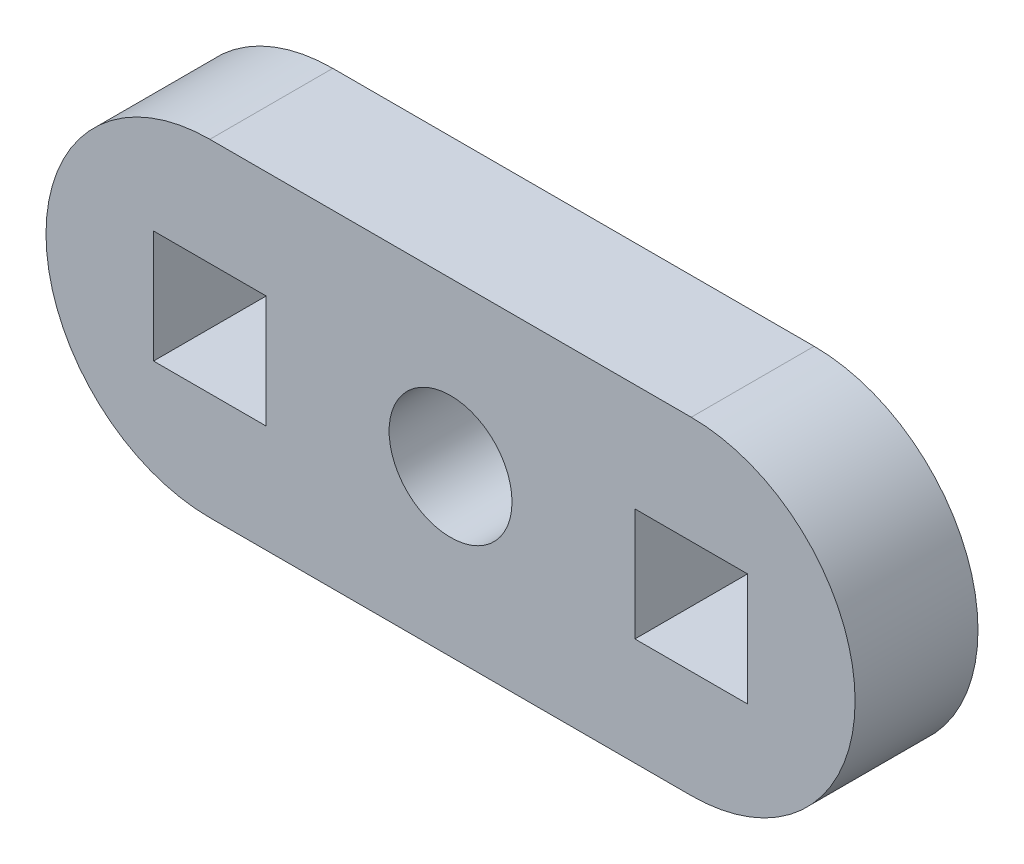
ISO-10303-21;
HEADER;
FILE_DESCRIPTION(('STEP AP214'),'2;1');
FILE_NAME('part.step','',(''),(''),'','','');
FILE_SCHEMA(('AUTOMOTIVE_DESIGN { 1 0 10303 214 1 1 1 1 }'));
ENDSEC;
DATA;
#1=APPLICATION_CONTEXT('core data for automotive mechanical design processes');
#2=APPLICATION_PROTOCOL_DEFINITION('international standard','automotive_design',2000,#1);
#3=PRODUCT_CONTEXT('',#1,'mechanical');
#4=PRODUCT('Part','Part','',(#3));
#5=PRODUCT_RELATED_PRODUCT_CATEGORY('part','',(#4));
#6=PRODUCT_DEFINITION_FORMATION('','',#4);
#7=PRODUCT_DEFINITION_CONTEXT('part definition',#1,'design');
#8=PRODUCT_DEFINITION('design','',#6,#7);
#9=PRODUCT_DEFINITION_SHAPE('','',#8);
#10=(LENGTH_UNIT() NAMED_UNIT(*) SI_UNIT(.MILLI.,.METRE.));
#11=(NAMED_UNIT(*) PLANE_ANGLE_UNIT() SI_UNIT($,.RADIAN.));
#12=(NAMED_UNIT(*) SI_UNIT($,.STERADIAN.) SOLID_ANGLE_UNIT());
#13=UNCERTAINTY_MEASURE_WITH_UNIT(LENGTH_MEASURE(1.E-05),#10,'distance_accuracy_value','');
#14=(GEOMETRIC_REPRESENTATION_CONTEXT(3) GLOBAL_UNCERTAINTY_ASSIGNED_CONTEXT((#13)) GLOBAL_UNIT_ASSIGNED_CONTEXT((#10,
#11,#12)) REPRESENTATION_CONTEXT('',''));
#15=CARTESIAN_POINT('',(0.,0.,0.));
#16=DIRECTION('',(0.,0.,1.));
#17=DIRECTION('',(1.,0.,0.));
#18=AXIS2_PLACEMENT_3D('',#15,#16,#17);
#19=CARTESIAN_POINT('',(48.445015479824,13.9509293096805,6.));
#20=DIRECTION('',(0.,0.,1.));
#21=DIRECTION('',(1.,0.,0.));
#22=AXIS2_PLACEMENT_3D('',#19,#20,#21);
#23=PLANE('',#22);
#24=DIRECTION('',(1.,0.,0.));
#25=VECTOR('',#24,1.);
#26=CARTESIAN_POINT('',(24.945015479824,21.9509293096805,6.));
#27=LINE('',#26,#25);
#28=CARTESIAN_POINT('',(24.945015479824,21.9509293096805,6.));
#29=VERTEX_POINT('',#28);
#30=CARTESIAN_POINT('',(48.445015479824,21.9509293096805,6.));
#31=VERTEX_POINT('',#30);
#32=EDGE_CURVE('E296',#29,#31,#27,.T.);
#33=ORIENTED_EDGE('',*,*,#32,.F.);
#34=CARTESIAN_POINT('',(24.9450154798213,13.9509293096807,6.));
#35=DIRECTION('',(0.,0.,1.));
#36=DIRECTION('',(1.,0.,0.));
#37=AXIS2_PLACEMENT_3D('',#34,#35,#36);
#38=CIRCLE('',#37,7.99999999999977);
#39=CARTESIAN_POINT('',(24.9450154798185,5.95092930968092,6.));
#40=VERTEX_POINT('',#39);
#41=EDGE_CURVE('E307',#29,#40,#38,.T.);
#42=ORIENTED_EDGE('',*,*,#41,.T.);
#43=DIRECTION('',(1.,0.,0.));
#44=VECTOR('',#43,1.);
#45=CARTESIAN_POINT('',(24.9450154798185,5.95092930968092,6.));
#46=LINE('',#45,#44);
#47=CARTESIAN_POINT('',(48.4450154798313,5.95092930968046,6.));
#48=VERTEX_POINT('',#47);
#49=EDGE_CURVE('E304',#40,#48,#46,.T.);
#50=ORIENTED_EDGE('',*,*,#49,.T.);
#51=CARTESIAN_POINT('',(48.445015479824,13.9509293096805,6.));
#52=DIRECTION('',(0.,0.,1.));
#53=DIRECTION('',(1.,0.,0.));
#54=AXIS2_PLACEMENT_3D('',#51,#52,#53);
#55=CIRCLE('',#54,8.);
#56=EDGE_CURVE('E300',#48,#31,#55,.T.);
#57=ORIENTED_EDGE('',*,*,#56,.T.);
#58=EDGE_LOOP('',(#33,#42,#50,#57));
#59=FACE_BOUND('',#58,.T.);
#60=DIRECTION('',(0.,1.,0.));
#61=VECTOR('',#60,1.);
#62=CARTESIAN_POINT('',(45.695015479824,0.,6.));
#63=LINE('',#62,#61);
#64=CARTESIAN_POINT('',(45.695015479824,11.2009293096796,6.));
#65=VERTEX_POINT('',#64);
#66=CARTESIAN_POINT('',(45.695015479824,16.7009293096796,6.));
#67=VERTEX_POINT('',#66);
#68=EDGE_CURVE('E252',#65,#67,#63,.T.);
#69=ORIENTED_EDGE('',*,*,#68,.T.);
#70=DIRECTION('',(1.,0.,0.));
#71=VECTOR('',#70,1.);
#72=CARTESIAN_POINT('',(0.,16.7009293096796,6.));
#73=LINE('',#72,#71);
#74=CARTESIAN_POINT('',(51.195015479824,16.7009293096796,6.));
#75=VERTEX_POINT('',#74);
#76=EDGE_CURVE('E265',#67,#75,#73,.T.);
#77=ORIENTED_EDGE('',*,*,#76,.T.);
#78=DIRECTION('',(0.,-1.,0.));
#79=VECTOR('',#78,1.);
#80=CARTESIAN_POINT('',(51.195015479824,0.,6.));
#81=LINE('',#80,#79);
#82=CARTESIAN_POINT('',(51.195015479824,11.2009293096796,6.));
#83=VERTEX_POINT('',#82);
#84=EDGE_CURVE('E261',#75,#83,#81,.T.);
#85=ORIENTED_EDGE('',*,*,#84,.T.);
#86=DIRECTION('',(-1.,0.,0.));
#87=VECTOR('',#86,1.);
#88=CARTESIAN_POINT('',(0.,11.2009293096796,6.));
#89=LINE('',#88,#87);
#90=EDGE_CURVE('E256',#83,#65,#89,.T.);
#91=ORIENTED_EDGE('',*,*,#90,.T.);
#92=EDGE_LOOP('',(#69,#77,#85,#91));
#93=FACE_BOUND('',#92,.T.);
#94=CARTESIAN_POINT('',(36.695015479824,13.9936662717261,6.));
#95=DIRECTION('',(0.,0.,1.));
#96=DIRECTION('',(1.,0.,0.));
#97=AXIS2_PLACEMENT_3D('',#94,#95,#96);
#98=CIRCLE('',#97,3.);
#99=CARTESIAN_POINT('',(39.695015479824,13.9936662717261,6.));
#100=VERTEX_POINT('',#99);
#101=EDGE_CURVE('E244',#100,#100,#98,.T.);
#102=ORIENTED_EDGE('',*,*,#101,.F.);
#103=EDGE_LOOP('',(#102));
#104=FACE_BOUND('',#103,.T.);
#105=DIRECTION('',(0.,1.,0.));
#106=VECTOR('',#105,1.);
#107=CARTESIAN_POINT('',(27.695015479824,11.2009293096796,6.));
#108=LINE('',#107,#106);
#109=CARTESIAN_POINT('',(27.695015479824,11.2009293096796,6.));
#110=VERTEX_POINT('',#109);
#111=CARTESIAN_POINT('',(27.695015479824,16.7009293096796,6.));
#112=VERTEX_POINT('',#111);
#113=EDGE_CURVE('E205',#110,#112,#108,.T.);
#114=ORIENTED_EDGE('',*,*,#113,.F.);
#115=DIRECTION('',(1.,0.,0.));
#116=VECTOR('',#115,1.);
#117=CARTESIAN_POINT('',(22.195015479824,11.2009293096796,6.));
#118=LINE('',#117,#116);
#119=CARTESIAN_POINT('',(22.195015479824,11.2009293096796,6.));
#120=VERTEX_POINT('',#119);
#121=EDGE_CURVE('E196',#120,#110,#118,.T.);
#122=ORIENTED_EDGE('',*,*,#121,.F.);
#123=DIRECTION('',(0.,-1.,0.));
#124=VECTOR('',#123,1.);
#125=CARTESIAN_POINT('',(22.195015479824,16.7009293096796,6.));
#126=LINE('',#125,#124);
#127=CARTESIAN_POINT('',(22.195015479824,16.7009293096796,6.));
#128=VERTEX_POINT('',#127);
#129=EDGE_CURVE('E222',#128,#120,#126,.T.);
#130=ORIENTED_EDGE('',*,*,#129,.F.);
#131=DIRECTION('',(-1.,0.,0.));
#132=VECTOR('',#131,1.);
#133=CARTESIAN_POINT('',(27.695015479824,16.7009293096796,6.));
#134=LINE('',#133,#132);
#135=EDGE_CURVE('E218',#112,#128,#134,.T.);
#136=ORIENTED_EDGE('',*,*,#135,.F.);
#137=EDGE_LOOP('',(#114,#122,#130,#136));
#138=FACE_BOUND('',#137,.T.);
#139=ADVANCED_FACE('F105',(#59,#93,#104,#138),#23,.T.);
#140=CARTESIAN_POINT('',(48.445015479824,13.9509293096805,0.));
#141=DIRECTION('',(0.,0.,1.));
#142=DIRECTION('',(1.,0.,0.));
#143=AXIS2_PLACEMENT_3D('',#140,#141,#142);
#144=PLANE('',#143);
#145=CARTESIAN_POINT('',(36.695015479824,13.9936662717261,0.));
#146=DIRECTION('',(0.,0.,1.));
#147=DIRECTION('',(1.,0.,0.));
#148=AXIS2_PLACEMENT_3D('',#145,#146,#147);
#149=CIRCLE('',#148,3.);
#150=CARTESIAN_POINT('',(39.695015479824,13.9936662717261,0.));
#151=VERTEX_POINT('',#150);
#152=EDGE_CURVE('E214',#151,#151,#149,.T.);
#153=ORIENTED_EDGE('',*,*,#152,.T.);
#154=EDGE_LOOP('',(#153));
#155=FACE_BOUND('',#154,.T.);
#156=DIRECTION('',(1.,0.,0.));
#157=VECTOR('',#156,1.);
#158=CARTESIAN_POINT('',(24.945015479824,21.9509293096805,0.));
#159=LINE('',#158,#157);
#160=CARTESIAN_POINT('',(24.945015479824,21.9509293096805,0.));
#161=VERTEX_POINT('',#160);
#162=CARTESIAN_POINT('',(48.445015479824,21.9509293096805,0.));
#163=VERTEX_POINT('',#162);
#164=EDGE_CURVE('E295',#161,#163,#159,.T.);
#165=ORIENTED_EDGE('',*,*,#164,.T.);
#166=CARTESIAN_POINT('',(48.445015479824,13.9509293096805,0.));
#167=DIRECTION('',(0.,0.,1.));
#168=DIRECTION('',(1.,0.,0.));
#169=AXIS2_PLACEMENT_3D('',#166,#167,#168);
#170=CIRCLE('',#169,8.);
#171=CARTESIAN_POINT('',(48.4450154798313,5.95092930968046,0.));
#172=VERTEX_POINT('',#171);
#173=EDGE_CURVE('E313',#172,#163,#170,.T.);
#174=ORIENTED_EDGE('',*,*,#173,.F.);
#175=DIRECTION('',(1.,0.,0.));
#176=VECTOR('',#175,1.);
#177=CARTESIAN_POINT('',(24.9450154798185,5.95092930968092,0.));
#178=LINE('',#177,#176);
#179=CARTESIAN_POINT('',(24.9450154798185,5.95092930968092,0.));
#180=VERTEX_POINT('',#179);
#181=EDGE_CURVE('E317',#180,#172,#178,.T.);
#182=ORIENTED_EDGE('',*,*,#181,.F.);
#183=CARTESIAN_POINT('',(24.9450154798213,13.9509293096807,0.));
#184=DIRECTION('',(0.,0.,1.));
#185=DIRECTION('',(1.,0.,0.));
#186=AXIS2_PLACEMENT_3D('',#183,#184,#185);
#187=CIRCLE('',#186,7.99999999999977);
#188=EDGE_CURVE('E301',#161,#180,#187,.T.);
#189=ORIENTED_EDGE('',*,*,#188,.F.);
#190=EDGE_LOOP('',(#165,#174,#182,#189));
#191=FACE_BOUND('',#190,.T.);
#192=DIRECTION('',(1.,0.,0.));
#193=VECTOR('',#192,1.);
#194=CARTESIAN_POINT('',(0.,16.7009293096796,0.));
#195=LINE('',#194,#193);
#196=CARTESIAN_POINT('',(45.695015479824,16.7009293096796,0.));
#197=VERTEX_POINT('',#196);
#198=CARTESIAN_POINT('',(51.195015479824,16.7009293096796,0.));
#199=VERTEX_POINT('',#198);
#200=EDGE_CURVE('E257',#197,#199,#195,.T.);
#201=ORIENTED_EDGE('',*,*,#200,.F.);
#202=DIRECTION('',(0.,1.,0.));
#203=VECTOR('',#202,1.);
#204=CARTESIAN_POINT('',(45.695015479824,0.,0.));
#205=LINE('',#204,#203);
#206=CARTESIAN_POINT('',(45.695015479824,11.2009293096796,0.));
#207=VERTEX_POINT('',#206);
#208=EDGE_CURVE('E248',#207,#197,#205,.T.);
#209=ORIENTED_EDGE('',*,*,#208,.F.);
#210=DIRECTION('',(-1.,0.,0.));
#211=VECTOR('',#210,1.);
#212=CARTESIAN_POINT('',(0.,11.2009293096796,0.));
#213=LINE('',#212,#211);
#214=CARTESIAN_POINT('',(51.195015479824,11.2009293096796,0.));
#215=VERTEX_POINT('',#214);
#216=EDGE_CURVE('E272',#215,#207,#213,.T.);
#217=ORIENTED_EDGE('',*,*,#216,.F.);
#218=DIRECTION('',(0.,-1.,0.));
#219=VECTOR('',#218,1.);
#220=CARTESIAN_POINT('',(51.195015479824,0.,0.));
#221=LINE('',#220,#219);
#222=EDGE_CURVE('E276',#199,#215,#221,.T.);
#223=ORIENTED_EDGE('',*,*,#222,.F.);
#224=EDGE_LOOP('',(#201,#209,#217,#223));
#225=FACE_BOUND('',#224,.T.);
#226=DIRECTION('',(1.,0.,0.));
#227=VECTOR('',#226,1.);
#228=CARTESIAN_POINT('',(22.195015479824,11.2009293096796,0.));
#229=LINE('',#228,#227);
#230=CARTESIAN_POINT('',(22.195015479824,11.2009293096796,0.));
#231=VERTEX_POINT('',#230);
#232=CARTESIAN_POINT('',(27.695015479824,11.2009293096796,0.));
#233=VERTEX_POINT('',#232);
#234=EDGE_CURVE('E131',#231,#233,#229,.T.);
#235=ORIENTED_EDGE('',*,*,#234,.T.);
#236=DIRECTION('',(0.,1.,0.));
#237=VECTOR('',#236,1.);
#238=CARTESIAN_POINT('',(27.695015479824,13.9509293096796,0.));
#239=LINE('',#238,#237);
#240=CARTESIAN_POINT('',(27.695015479824,16.7009293096796,0.));
#241=VERTEX_POINT('',#240);
#242=EDGE_CURVE('E212',#233,#241,#239,.T.);
#243=ORIENTED_EDGE('',*,*,#242,.T.);
#244=DIRECTION('',(-1.,0.,0.));
#245=VECTOR('',#244,1.);
#246=CARTESIAN_POINT('',(27.695015479824,16.7009293096796,0.));
#247=LINE('',#246,#245);
#248=CARTESIAN_POINT('',(22.195015479824,16.7009293096796,0.));
#249=VERTEX_POINT('',#248);
#250=EDGE_CURVE('E231',#241,#249,#247,.T.);
#251=ORIENTED_EDGE('',*,*,#250,.T.);
#252=DIRECTION('',(0.,-1.,0.));
#253=VECTOR('',#252,1.);
#254=CARTESIAN_POINT('',(22.195015479824,16.7009293096796,0.));
#255=LINE('',#254,#253);
#256=EDGE_CURVE('E206',#249,#231,#255,.T.);
#257=ORIENTED_EDGE('',*,*,#256,.T.);
#258=EDGE_LOOP('',(#235,#243,#251,#257));
#259=FACE_BOUND('',#258,.T.);
#260=ADVANCED_FACE('F340',(#155,#191,#225,#259),#144,.F.);
#261=CARTESIAN_POINT('',(24.945015479824,21.9509293096805,6.));
#262=DIRECTION('',(0.,1.,0.));
#263=DIRECTION('',(0.,0.,1.));
#264=AXIS2_PLACEMENT_3D('',#261,#262,#263);
#265=PLANE('',#264);
#266=ORIENTED_EDGE('',*,*,#164,.F.);
#267=DIRECTION('',(0.,0.,-1.));
#268=VECTOR('',#267,1.);
#269=CARTESIAN_POINT('',(24.945015479824,21.9509293096805,6.));
#270=LINE('',#269,#268);
#271=EDGE_CURVE('E12',#29,#161,#270,.T.);
#272=ORIENTED_EDGE('',*,*,#271,.F.);
#273=ORIENTED_EDGE('',*,*,#32,.T.);
#274=DIRECTION('',(0.,0.,-1.));
#275=VECTOR('',#274,1.);
#276=CARTESIAN_POINT('',(48.445015479824,21.9509293096805,6.));
#277=LINE('',#276,#275);
#278=EDGE_CURVE('E109',#31,#163,#277,.T.);
#279=ORIENTED_EDGE('',*,*,#278,.T.);
#280=EDGE_LOOP('',(#266,#272,#273,#279));
#281=FACE_BOUND('',#280,.T.);
#282=ADVANCED_FACE('F107',(#281),#265,.T.);
#283=CARTESIAN_POINT('',(24.9450154798213,13.9509293096807,6.));
#284=DIRECTION('',(0.,0.,-1.));
#285=DIRECTION('',(-1.,0.,0.));
#286=AXIS2_PLACEMENT_3D('',#283,#284,#285);
#287=CYLINDRICAL_SURFACE('',#286,7.99999999999977);
#288=ORIENTED_EDGE('',*,*,#188,.T.);
#289=DIRECTION('',(0.,0.,-1.));
#290=VECTOR('',#289,1.);
#291=CARTESIAN_POINT('',(24.9450154798185,5.95092930968092,6.));
#292=LINE('',#291,#290);
#293=EDGE_CURVE('E115',#40,#180,#292,.T.);
#294=ORIENTED_EDGE('',*,*,#293,.F.);
#295=ORIENTED_EDGE('',*,*,#41,.F.);
#296=ORIENTED_EDGE('',*,*,#271,.T.);
#297=EDGE_LOOP('',(#288,#294,#295,#296));
#298=FACE_BOUND('',#297,.T.);
#299=ADVANCED_FACE('F344',(#298),#287,.T.);
#300=CARTESIAN_POINT('',(24.9450154798185,5.95092930968092,6.));
#301=DIRECTION('',(0.,1.,0.));
#302=DIRECTION('',(-1.,0.,0.));
#303=AXIS2_PLACEMENT_3D('',#300,#301,#302);
#304=PLANE('',#303);
#305=ORIENTED_EDGE('',*,*,#181,.T.);
#306=DIRECTION('',(0.,0.,-1.));
#307=VECTOR('',#306,1.);
#308=CARTESIAN_POINT('',(48.4450154798313,5.95092930968046,6.));
#309=LINE('',#308,#307);
#310=EDGE_CURVE('E324',#48,#172,#309,.T.);
#311=ORIENTED_EDGE('',*,*,#310,.F.);
#312=ORIENTED_EDGE('',*,*,#49,.F.);
#313=ORIENTED_EDGE('',*,*,#293,.T.);
#314=EDGE_LOOP('',(#305,#311,#312,#313));
#315=FACE_BOUND('',#314,.T.);
#316=ADVANCED_FACE('F348',(#315),#304,.F.);
#317=CARTESIAN_POINT('',(48.445015479824,13.9509293096805,6.));
#318=DIRECTION('',(0.,0.,-1.));
#319=DIRECTION('',(-1.,0.,0.));
#320=AXIS2_PLACEMENT_3D('',#317,#318,#319);
#321=CYLINDRICAL_SURFACE('',#320,8.);
#322=ORIENTED_EDGE('',*,*,#173,.T.);
#323=ORIENTED_EDGE('',*,*,#278,.F.);
#324=ORIENTED_EDGE('',*,*,#56,.F.);
#325=ORIENTED_EDGE('',*,*,#310,.T.);
#326=EDGE_LOOP('',(#322,#323,#324,#325));
#327=FACE_BOUND('',#326,.T.);
#328=ADVANCED_FACE('F336',(#327),#321,.T.);
#329=CARTESIAN_POINT('',(45.695015479824,0.,6.));
#330=DIRECTION('',(-1.,0.,0.));
#331=DIRECTION('',(0.,0.,1.));
#332=AXIS2_PLACEMENT_3D('',#329,#330,#331);
#333=PLANE('',#332);
#334=ORIENTED_EDGE('',*,*,#208,.T.);
#335=DIRECTION('',(0.,0.,-1.));
#336=VECTOR('',#335,1.);
#337=CARTESIAN_POINT('',(45.695015479824,16.7009293096796,6.));
#338=LINE('',#337,#336);
#339=EDGE_CURVE('E269',#67,#197,#338,.T.);
#340=ORIENTED_EDGE('',*,*,#339,.F.);
#341=ORIENTED_EDGE('',*,*,#68,.F.);
#342=DIRECTION('',(0.,0.,-1.));
#343=VECTOR('',#342,1.);
#344=CARTESIAN_POINT('',(45.695015479824,11.2009293096796,6.));
#345=LINE('',#344,#343);
#346=EDGE_CURVE('E292',#65,#207,#345,.T.);
#347=ORIENTED_EDGE('',*,*,#346,.T.);
#348=EDGE_LOOP('',(#334,#340,#341,#347));
#349=FACE_BOUND('',#348,.T.);
#350=ADVANCED_FACE('F375',(#349),#333,.F.);
#351=CARTESIAN_POINT('',(0.,11.2009293096796,6.));
#352=DIRECTION('',(0.,-1.,0.));
#353=DIRECTION('',(0.,0.,-1.));
#354=AXIS2_PLACEMENT_3D('',#351,#352,#353);
#355=PLANE('',#354);
#356=ORIENTED_EDGE('',*,*,#216,.T.);
#357=ORIENTED_EDGE('',*,*,#346,.F.);
#358=ORIENTED_EDGE('',*,*,#90,.F.);
#359=DIRECTION('',(0.,0.,-1.));
#360=VECTOR('',#359,1.);
#361=CARTESIAN_POINT('',(51.195015479824,11.2009293096796,6.));
#362=LINE('',#361,#360);
#363=EDGE_CURVE('E289',#83,#215,#362,.T.);
#364=ORIENTED_EDGE('',*,*,#363,.T.);
#365=EDGE_LOOP('',(#356,#357,#358,#364));
#366=FACE_BOUND('',#365,.T.);
#367=ADVANCED_FACE('F379',(#366),#355,.F.);
#368=CARTESIAN_POINT('',(51.195015479824,0.,6.));
#369=DIRECTION('',(1.,0.,0.));
#370=DIRECTION('',(0.,0.,-1.));
#371=AXIS2_PLACEMENT_3D('',#368,#369,#370);
#372=PLANE('',#371);
#373=ORIENTED_EDGE('',*,*,#222,.T.);
#374=ORIENTED_EDGE('',*,*,#363,.F.);
#375=ORIENTED_EDGE('',*,*,#84,.F.);
#376=DIRECTION('',(0.,0.,-1.));
#377=VECTOR('',#376,1.);
#378=CARTESIAN_POINT('',(51.195015479824,16.7009293096796,6.));
#379=LINE('',#378,#377);
#380=EDGE_CURVE('E286',#75,#199,#379,.T.);
#381=ORIENTED_EDGE('',*,*,#380,.T.);
#382=EDGE_LOOP('',(#373,#374,#375,#381));
#383=FACE_BOUND('',#382,.T.);
#384=ADVANCED_FACE('F384',(#383),#372,.F.);
#385=CARTESIAN_POINT('',(0.,16.7009293096796,6.));
#386=DIRECTION('',(0.,1.,0.));
#387=DIRECTION('',(0.,0.,1.));
#388=AXIS2_PLACEMENT_3D('',#385,#386,#387);
#389=PLANE('',#388);
#390=ORIENTED_EDGE('',*,*,#200,.T.);
#391=ORIENTED_EDGE('',*,*,#380,.F.);
#392=ORIENTED_EDGE('',*,*,#76,.F.);
#393=ORIENTED_EDGE('',*,*,#339,.T.);
#394=EDGE_LOOP('',(#390,#391,#392,#393));
#395=FACE_BOUND('',#394,.T.);
#396=ADVANCED_FACE('F360',(#395),#389,.F.);
#397=CARTESIAN_POINT('',(36.695015479824,13.9936662717261,6.));
#398=DIRECTION('',(0.,0.,-1.));
#399=DIRECTION('',(-1.,0.,0.));
#400=AXIS2_PLACEMENT_3D('',#397,#398,#399);
#401=CYLINDRICAL_SURFACE('',#400,3.);
#402=ORIENTED_EDGE('',*,*,#101,.T.);
#403=EDGE_LOOP('',(#402));
#404=FACE_BOUND('',#403,.T.);
#405=ORIENTED_EDGE('',*,*,#152,.F.);
#406=EDGE_LOOP('',(#405));
#407=FACE_BOUND('',#406,.T.);
#408=ADVANCED_FACE('F357',(#404,#407),#401,.F.);
#409=CARTESIAN_POINT('',(22.195015479824,11.2009293096796,6.));
#410=DIRECTION('',(0.,1.,0.));
#411=DIRECTION('',(0.,0.,1.));
#412=AXIS2_PLACEMENT_3D('',#409,#410,#411);
#413=PLANE('',#412);
#414=ORIENTED_EDGE('',*,*,#234,.F.);
#415=DIRECTION('',(0.,0.,-1.));
#416=VECTOR('',#415,1.);
#417=CARTESIAN_POINT('',(22.195015479824,11.2009293096796,6.));
#418=LINE('',#417,#416);
#419=EDGE_CURVE('E200',#120,#231,#418,.T.);
#420=ORIENTED_EDGE('',*,*,#419,.F.);
#421=ORIENTED_EDGE('',*,*,#121,.T.);
#422=DIRECTION('',(0.,0.,-1.));
#423=VECTOR('',#422,1.);
#424=CARTESIAN_POINT('',(27.695015479824,11.2009293096796,6.));
#425=LINE('',#424,#423);
#426=EDGE_CURVE('E199',#110,#233,#425,.T.);
#427=ORIENTED_EDGE('',*,*,#426,.T.);
#428=EDGE_LOOP('',(#414,#420,#421,#427));
#429=FACE_BOUND('',#428,.T.);
#430=ADVANCED_FACE('F198',(#429),#413,.T.);
#431=CARTESIAN_POINT('',(27.695015479824,13.9509293096796,6.));
#432=DIRECTION('',(-1.,0.,0.));
#433=DIRECTION('',(0.,0.,1.));
#434=AXIS2_PLACEMENT_3D('',#431,#432,#433);
#435=PLANE('',#434);
#436=ORIENTED_EDGE('',*,*,#242,.F.);
#437=ORIENTED_EDGE('',*,*,#426,.F.);
#438=ORIENTED_EDGE('',*,*,#113,.T.);
#439=DIRECTION('',(0.,0.,-1.));
#440=VECTOR('',#439,1.);
#441=CARTESIAN_POINT('',(27.695015479824,16.7009293096796,6.));
#442=LINE('',#441,#440);
#443=EDGE_CURVE('E215',#112,#241,#442,.T.);
#444=ORIENTED_EDGE('',*,*,#443,.T.);
#445=EDGE_LOOP('',(#436,#437,#438,#444));
#446=FACE_BOUND('',#445,.T.);
#447=ADVANCED_FACE('F209',(#446),#435,.T.);
#448=CARTESIAN_POINT('',(27.695015479824,16.7009293096796,6.));
#449=DIRECTION('',(0.,-1.,0.));
#450=DIRECTION('',(0.,0.,-1.));
#451=AXIS2_PLACEMENT_3D('',#448,#449,#450);
#452=PLANE('',#451);
#453=ORIENTED_EDGE('',*,*,#250,.F.);
#454=ORIENTED_EDGE('',*,*,#443,.F.);
#455=ORIENTED_EDGE('',*,*,#135,.T.);
#456=DIRECTION('',(0.,0.,-1.));
#457=VECTOR('',#456,1.);
#458=CARTESIAN_POINT('',(22.195015479824,16.7009293096796,6.));
#459=LINE('',#458,#457);
#460=EDGE_CURVE('E123',#128,#249,#459,.T.);
#461=ORIENTED_EDGE('',*,*,#460,.T.);
#462=EDGE_LOOP('',(#453,#454,#455,#461));
#463=FACE_BOUND('',#462,.T.);
#464=ADVANCED_FACE('F398',(#463),#452,.T.);
#465=CARTESIAN_POINT('',(22.195015479824,16.7009293096796,6.));
#466=DIRECTION('',(1.,0.,0.));
#467=DIRECTION('',(0.,0.,-1.));
#468=AXIS2_PLACEMENT_3D('',#465,#466,#467);
#469=PLANE('',#468);
#470=ORIENTED_EDGE('',*,*,#256,.F.);
#471=ORIENTED_EDGE('',*,*,#460,.F.);
#472=ORIENTED_EDGE('',*,*,#129,.T.);
#473=ORIENTED_EDGE('',*,*,#419,.T.);
#474=EDGE_LOOP('',(#470,#471,#472,#473));
#475=FACE_BOUND('',#474,.T.);
#476=ADVANCED_FACE('F401',(#475),#469,.T.);
#477=CLOSED_SHELL('',(#139,#260,#282,#299,#316,#328,#350,#367,#384,#396,#408,#430,#447,#464,#476));
#478=MANIFOLD_SOLID_BREP('B2',#477);
#479=ADVANCED_BREP_SHAPE_REPRESENTATION('',(#18,#478),#14);
#480=SHAPE_DEFINITION_REPRESENTATION(#9,#479);
ENDSEC;
END-ISO-10303-21;
